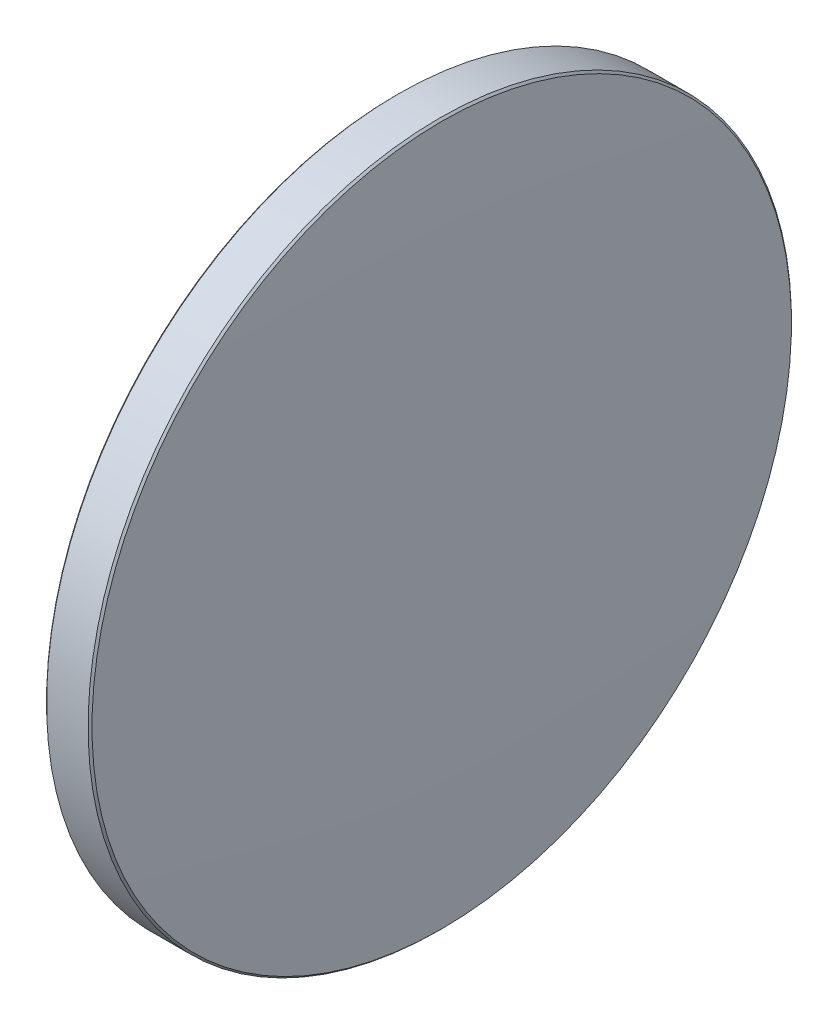
ISO-10303-21;
HEADER;
FILE_DESCRIPTION(('STEP AP214'),'2;1');
FILE_NAME('part.step','',(''),(''),'','','');
FILE_SCHEMA(('AUTOMOTIVE_DESIGN { 1 0 10303 214 1 1 1 1 }'));
ENDSEC;
DATA;
#1=APPLICATION_CONTEXT('core data for automotive mechanical design processes');
#2=APPLICATION_PROTOCOL_DEFINITION('international standard','automotive_design',2000,#1);
#3=PRODUCT_CONTEXT('',#1,'mechanical');
#4=PRODUCT('Part','Part','',(#3));
#5=PRODUCT_RELATED_PRODUCT_CATEGORY('part','',(#4));
#6=PRODUCT_DEFINITION_FORMATION('','',#4);
#7=PRODUCT_DEFINITION_CONTEXT('part definition',#1,'design');
#8=PRODUCT_DEFINITION('design','',#6,#7);
#9=PRODUCT_DEFINITION_SHAPE('','',#8);
#10=(LENGTH_UNIT() NAMED_UNIT(*) SI_UNIT(.MILLI.,.METRE.));
#11=(NAMED_UNIT(*) PLANE_ANGLE_UNIT() SI_UNIT($,.RADIAN.));
#12=(NAMED_UNIT(*) SI_UNIT($,.STERADIAN.) SOLID_ANGLE_UNIT());
#13=UNCERTAINTY_MEASURE_WITH_UNIT(LENGTH_MEASURE(1.E-05),#10,'distance_accuracy_value','');
#14=(GEOMETRIC_REPRESENTATION_CONTEXT(3) GLOBAL_UNCERTAINTY_ASSIGNED_CONTEXT((#13)) GLOBAL_UNIT_ASSIGNED_CONTEXT((#10,
#11,#12)) REPRESENTATION_CONTEXT('',''));
#15=CARTESIAN_POINT('',(0.,0.,0.));
#16=DIRECTION('',(0.,0.,1.));
#17=DIRECTION('',(1.,0.,0.));
#18=AXIS2_PLACEMENT_3D('',#15,#16,#17);
#19=CARTESIAN_POINT('',(917.736208115596,-5.03645148681666,0.));
#20=DIRECTION('',(0.,0.,-1.));
#21=DIRECTION('',(0.,-1.,0.));
#22=AXIS2_PLACEMENT_3D('',#19,#20,#21);
#23=CIRCLE('',#22,919.6);
#24=TRIMMED_CURVE('',#23,(PARAMETER_VALUE(-1.57627313917567)),
(PARAMETER_VALUE(1.57627313917567)),.T.,.PARAMETER.);
#25=CARTESIAN_POINT('',(917.736208115596,1.69135538907739E-13,0.));
#26=DIRECTION('',(-1.,0.,0.));
#27=AXIS1_PLACEMENT('',#25,#26);
#28=SURFACE_OF_REVOLUTION('',#24,#27);
#29=CARTESIAN_POINT('',(-1.85,0.,0.));
#30=VERTEX_POINT('',#29);
#31=VERTEX_LOOP('',#30);
#32=FACE_BOUND('',#31,.T.);
#33=CARTESIAN_POINT('',(-1.6414213562373,0.,0.));
#34=DIRECTION('',(-1.,0.,0.));
#35=DIRECTION('',(0.,-1.,0.));
#36=AXIS2_PLACEMENT_3D('',#33,#34,#35);
#37=CIRCLE('',#36,25.2585786437627);
#38=CARTESIAN_POINT('',(-1.6414213562373,-25.2585786437627,0.));
#39=VERTEX_POINT('',#38);
#40=EDGE_CURVE('E10',#39,#39,#37,.T.);
#41=ORIENTED_EDGE('',*,*,#40,.T.);
#42=EDGE_LOOP('',(#41));
#43=FACE_BOUND('',#42,.T.);
#44=ADVANCED_FACE('F15',(#32,#43),#28,.T.);
#45=CARTESIAN_POINT('',(-1.5,0.,0.));
#46=DIRECTION('',(1.,0.,0.));
#47=DIRECTION('',(0.,1.,0.));
#48=AXIS2_PLACEMENT_3D('',#45,#46,#47);
#49=CONICAL_SURFACE('',#48,25.4,0.785398163397449);
#50=ORIENTED_EDGE('',*,*,#40,.F.);
#51=EDGE_LOOP('',(#50));
#52=FACE_BOUND('',#51,.T.);
#53=CARTESIAN_POINT('',(-1.5,0.,0.));
#54=DIRECTION('',(-1.,0.,0.));
#55=DIRECTION('',(0.,-1.,0.));
#56=AXIS2_PLACEMENT_3D('',#53,#54,#55);
#57=CIRCLE('',#56,25.4);
#58=CARTESIAN_POINT('',(-1.49999999999999,-25.4,0.));
#59=VERTEX_POINT('',#58);
#60=EDGE_CURVE('E22',#59,#59,#57,.T.);
#61=ORIENTED_EDGE('',*,*,#60,.T.);
#62=EDGE_LOOP('',(#61));
#63=FACE_BOUND('',#62,.T.);
#64=ADVANCED_FACE('F30',(#52,#63),#49,.T.);
#65=CARTESIAN_POINT('',(-1.85,0.,0.));
#66=DIRECTION('',(-1.,0.,0.));
#67=DIRECTION('',(0.,-1.,0.));
#68=AXIS2_PLACEMENT_3D('',#65,#66,#67);
#69=CYLINDRICAL_SURFACE('',#68,25.4);
#70=ORIENTED_EDGE('',*,*,#60,.F.);
#71=EDGE_LOOP('',(#70));
#72=FACE_BOUND('',#71,.T.);
#73=CARTESIAN_POINT('',(1.5,0.,0.));
#74=DIRECTION('',(-1.,0.,0.));
#75=DIRECTION('',(0.,-1.,0.));
#76=AXIS2_PLACEMENT_3D('',#73,#74,#75);
#77=CIRCLE('',#76,25.4);
#78=CARTESIAN_POINT('',(1.50000000000001,-25.4,0.));
#79=VERTEX_POINT('',#78);
#80=EDGE_CURVE('E39',#79,#79,#77,.T.);
#81=ORIENTED_EDGE('',*,*,#80,.T.);
#82=EDGE_LOOP('',(#81));
#83=FACE_BOUND('',#82,.T.);
#84=ADVANCED_FACE('F35',(#72,#83),#69,.T.);
#85=CARTESIAN_POINT('',(1.64142135623735,0.,0.));
#86=DIRECTION('',(-1.,0.,0.));
#87=DIRECTION('',(0.,-1.,0.));
#88=AXIS2_PLACEMENT_3D('',#85,#86,#87);
#89=CONICAL_SURFACE('',#88,25.2585786437626,0.785398163397517);
#90=ORIENTED_EDGE('',*,*,#80,.F.);
#91=EDGE_LOOP('',(#90));
#92=FACE_BOUND('',#91,.T.);
#93=CARTESIAN_POINT('',(1.64142135623735,0.,0.));
#94=DIRECTION('',(-1.,0.,0.));
#95=DIRECTION('',(0.,-1.,0.));
#96=AXIS2_PLACEMENT_3D('',#93,#94,#95);
#97=CIRCLE('',#96,25.2585786437626);
#98=CARTESIAN_POINT('',(1.64142135623736,-25.2585786437626,0.));
#99=VERTEX_POINT('',#98);
#100=EDGE_CURVE('E41',#99,#99,#97,.T.);
#101=ORIENTED_EDGE('',*,*,#100,.T.);
#102=EDGE_LOOP('',(#101));
#103=FACE_BOUND('',#102,.T.);
#104=ADVANCED_FACE('F47',(#92,#103),#89,.T.);
#105=CARTESIAN_POINT('',(-917.736208115596,-5.03645148681745,0.));
#106=DIRECTION('',(0.,0.,-1.));
#107=DIRECTION('',(0.,-1.,0.));
#108=AXIS2_PLACEMENT_3D('',#105,#106,#107);
#109=CIRCLE('',#108,919.6);
#110=TRIMMED_CURVE('',#109,(PARAMETER_VALUE(-1.57627313917567)),
(PARAMETER_VALUE(1.57627313917567)),.T.,.PARAMETER.);
#111=CARTESIAN_POINT('',(-917.736208115596,-1.6826817716975E-13,0.));
#112=DIRECTION('',(-1.,0.,0.));
#113=AXIS1_PLACEMENT('',#111,#112);
#114=SURFACE_OF_REVOLUTION('',#110,#113);
#115=ORIENTED_EDGE('',*,*,#100,.F.);
#116=EDGE_LOOP('',(#115));
#117=FACE_BOUND('',#116,.T.);
#118=CARTESIAN_POINT('',(1.85,0.,0.));
#119=VERTEX_POINT('',#118);
#120=VERTEX_LOOP('',#119);
#121=FACE_BOUND('',#120,.T.);
#122=ADVANCED_FACE('F49',(#117,#121),#114,.T.);
#123=CLOSED_SHELL('',(#44,#64,#84,#104,#122));
#124=MANIFOLD_SOLID_BREP('B1',#123);
#125=ADVANCED_BREP_SHAPE_REPRESENTATION('',(#18,#124),#14);
#126=SHAPE_DEFINITION_REPRESENTATION(#9,#125);
ENDSEC;
END-ISO-10303-21;
